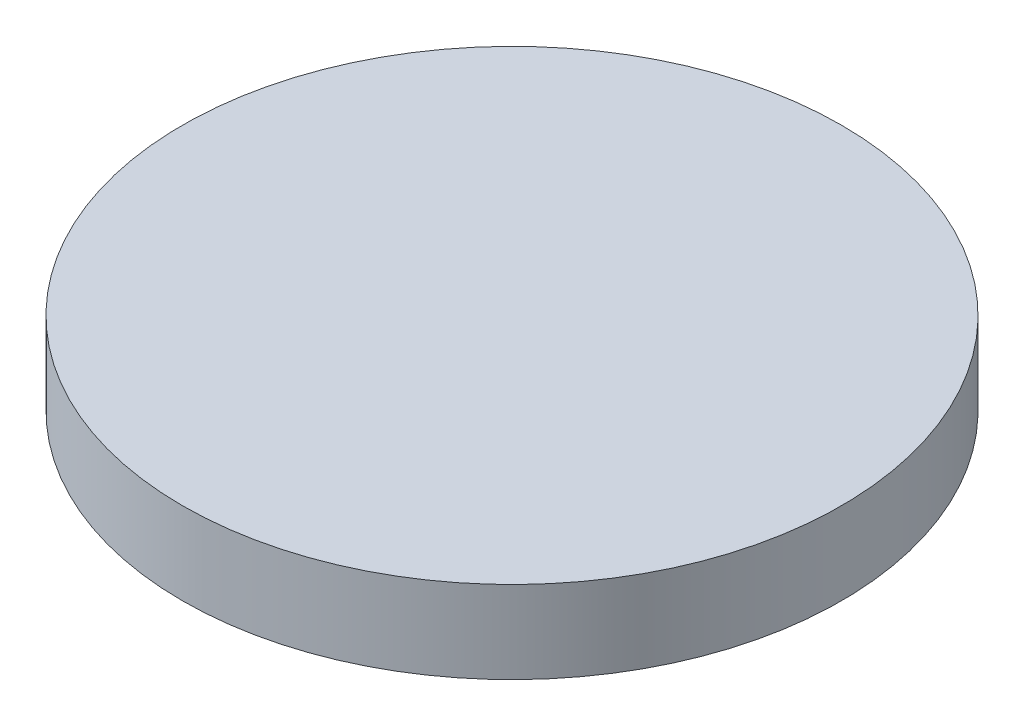
ISO-10303-21;
HEADER;
FILE_DESCRIPTION(('STEP AP214'),'2;1');
FILE_NAME('part.step','',(''),(''),'','','');
FILE_SCHEMA(('AUTOMOTIVE_DESIGN { 1 0 10303 214 1 1 1 1 }'));
ENDSEC;
DATA;
#1=APPLICATION_CONTEXT('core data for automotive mechanical design processes');
#2=APPLICATION_PROTOCOL_DEFINITION('international standard','automotive_design',2000,#1);
#3=PRODUCT_CONTEXT('',#1,'mechanical');
#4=PRODUCT('Part','Part','',(#3));
#5=PRODUCT_RELATED_PRODUCT_CATEGORY('part','',(#4));
#6=PRODUCT_DEFINITION_FORMATION('','',#4);
#7=PRODUCT_DEFINITION_CONTEXT('part definition',#1,'design');
#8=PRODUCT_DEFINITION('design','',#6,#7);
#9=PRODUCT_DEFINITION_SHAPE('','',#8);
#10=(LENGTH_UNIT() NAMED_UNIT(*) SI_UNIT(.MILLI.,.METRE.));
#11=(NAMED_UNIT(*) PLANE_ANGLE_UNIT() SI_UNIT($,.RADIAN.));
#12=(NAMED_UNIT(*) SI_UNIT($,.STERADIAN.) SOLID_ANGLE_UNIT());
#13=UNCERTAINTY_MEASURE_WITH_UNIT(LENGTH_MEASURE(1.E-05),#10,'distance_accuracy_value','');
#14=(GEOMETRIC_REPRESENTATION_CONTEXT(3) GLOBAL_UNCERTAINTY_ASSIGNED_CONTEXT((#13)) GLOBAL_UNIT_ASSIGNED_CONTEXT((#10,
#11,#12)) REPRESENTATION_CONTEXT('',''));
#15=CARTESIAN_POINT('',(0.,0.,0.));
#16=DIRECTION('',(0.,0.,1.));
#17=DIRECTION('',(1.,0.,0.));
#18=AXIS2_PLACEMENT_3D('',#15,#16,#17);
#19=CARTESIAN_POINT('',(0.,38.1,0.));
#20=DIRECTION('',(0.,-1.,0.));
#21=DIRECTION('',(0.,0.,-1.));
#22=AXIS2_PLACEMENT_3D('',#19,#20,#21);
#23=CYLINDRICAL_SURFACE('',#22,152.4);
#24=CARTESIAN_POINT('',(0.,38.1,0.));
#25=DIRECTION('',(0.,1.,0.));
#26=DIRECTION('',(0.,0.,1.));
#27=AXIS2_PLACEMENT_3D('',#24,#25,#26);
#28=CIRCLE('',#27,152.4);
#29=CARTESIAN_POINT('',(0.,38.1,152.4));
#30=VERTEX_POINT('',#29);
#31=EDGE_CURVE('E10',#30,#30,#28,.T.);
#32=ORIENTED_EDGE('',*,*,#31,.F.);
#33=EDGE_LOOP('',(#32));
#34=FACE_BOUND('',#33,.T.);
#35=CARTESIAN_POINT('',(0.,0.,0.));
#36=DIRECTION('',(0.,1.,0.));
#37=DIRECTION('',(0.,0.,1.));
#38=AXIS2_PLACEMENT_3D('',#35,#36,#37);
#39=CIRCLE('',#38,152.4);
#40=CARTESIAN_POINT('',(0.,0.,152.4));
#41=VERTEX_POINT('',#40);
#42=EDGE_CURVE('E36',#41,#41,#39,.T.);
#43=ORIENTED_EDGE('',*,*,#42,.T.);
#44=EDGE_LOOP('',(#43));
#45=FACE_BOUND('',#44,.T.);
#46=ADVANCED_FACE('F33',(#34,#45),#23,.T.);
#47=CARTESIAN_POINT('',(0.,38.1,0.));
#48=DIRECTION('',(0.,1.,0.));
#49=DIRECTION('',(0.,0.,1.));
#50=AXIS2_PLACEMENT_3D('',#47,#48,#49);
#51=PLANE('',#50);
#52=ORIENTED_EDGE('',*,*,#31,.T.);
#53=EDGE_LOOP('',(#52));
#54=FACE_BOUND('',#53,.T.);
#55=ADVANCED_FACE('F48',(#54),#51,.T.);
#56=CARTESIAN_POINT('',(0.,0.,0.));
#57=DIRECTION('',(0.,1.,0.));
#58=DIRECTION('',(0.,0.,1.));
#59=AXIS2_PLACEMENT_3D('',#56,#57,#58);
#60=PLANE('',#59);
#61=ORIENTED_EDGE('',*,*,#42,.F.);
#62=EDGE_LOOP('',(#61));
#63=FACE_BOUND('',#62,.T.);
#64=ADVANCED_FACE('F46',(#63),#60,.F.);
#65=CLOSED_SHELL('',(#46,#55,#64));
#66=MANIFOLD_SOLID_BREP('B2',#65);
#67=ADVANCED_BREP_SHAPE_REPRESENTATION('',(#18,#66),#14);
#68=SHAPE_DEFINITION_REPRESENTATION(#9,#67);
ENDSEC;
END-ISO-10303-21;
